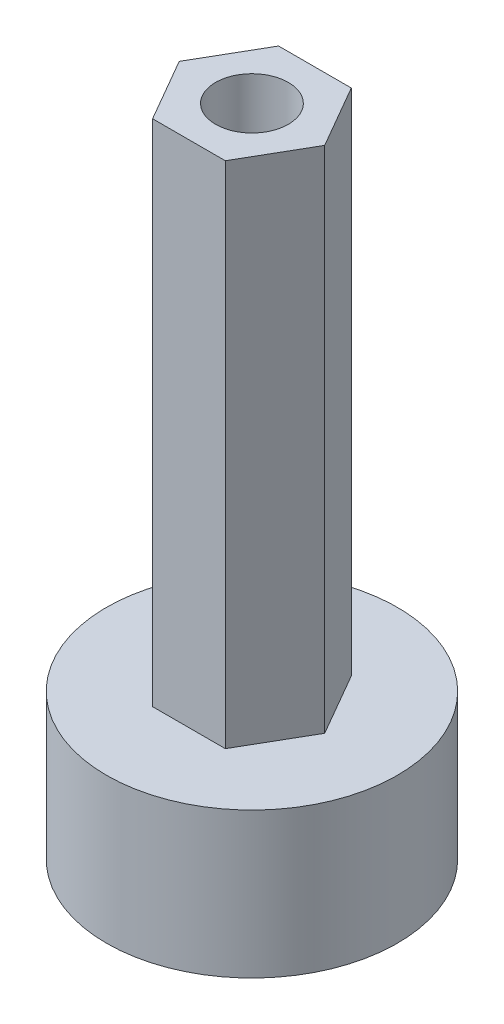
ISO-10303-21;
HEADER;
FILE_DESCRIPTION(('STEP AP214'),'2;1');
FILE_NAME('part.step','',(''),(''),'','','');
FILE_SCHEMA(('AUTOMOTIVE_DESIGN { 1 0 10303 214 1 1 1 1 }'));
ENDSEC;
DATA;
#1=APPLICATION_CONTEXT('core data for automotive mechanical design processes');
#2=APPLICATION_PROTOCOL_DEFINITION('international standard','automotive_design',2000,#1);
#3=PRODUCT_CONTEXT('',#1,'mechanical');
#4=PRODUCT('Part','Part','',(#3));
#5=PRODUCT_RELATED_PRODUCT_CATEGORY('part','',(#4));
#6=PRODUCT_DEFINITION_FORMATION('','',#4);
#7=PRODUCT_DEFINITION_CONTEXT('part definition',#1,'design');
#8=PRODUCT_DEFINITION('design','',#6,#7);
#9=PRODUCT_DEFINITION_SHAPE('','',#8);
#10=(LENGTH_UNIT() NAMED_UNIT(*) SI_UNIT(.MILLI.,.METRE.));
#11=(NAMED_UNIT(*) PLANE_ANGLE_UNIT() SI_UNIT($,.RADIAN.));
#12=(NAMED_UNIT(*) SI_UNIT($,.STERADIAN.) SOLID_ANGLE_UNIT());
#13=UNCERTAINTY_MEASURE_WITH_UNIT(LENGTH_MEASURE(1.E-05),#10,'distance_accuracy_value','');
#14=(GEOMETRIC_REPRESENTATION_CONTEXT(3) GLOBAL_UNCERTAINTY_ASSIGNED_CONTEXT((#13)) GLOBAL_UNIT_ASSIGNED_CONTEXT((#10,
#11,#12)) REPRESENTATION_CONTEXT('',''));
#15=CARTESIAN_POINT('',(0.,0.,0.));
#16=DIRECTION('',(0.,0.,1.));
#17=DIRECTION('',(1.,0.,0.));
#18=AXIS2_PLACEMENT_3D('',#15,#16,#17);
#19=CARTESIAN_POINT('',(3.175,28.575,0.));
#20=DIRECTION('',(0.,-1.,0.));
#21=DIRECTION('',(0.,0.,-1.));
#22=AXIS2_PLACEMENT_3D('',#19,#20,#21);
#23=PLANE('',#22);
#24=CARTESIAN_POINT('',(0.,28.575,0.));
#25=DIRECTION('',(0.,1.,0.));
#26=DIRECTION('',(0.,0.,1.));
#27=AXIS2_PLACEMENT_3D('',#24,#25,#26);
#28=CIRCLE('',#27,1.58749999999999);
#29=CARTESIAN_POINT('',(0.,28.575,1.58749999999999));
#30=VERTEX_POINT('',#29);
#31=EDGE_CURVE('E277',#30,#30,#28,.T.);
#32=ORIENTED_EDGE('',*,*,#31,.F.);
#33=EDGE_LOOP('',(#32));
#34=FACE_BOUND('',#33,.T.);
#35=DIRECTION('',(0.5,0.,0.866025403784438));
#36=VECTOR('',#35,1.);
#37=CARTESIAN_POINT('',(-2.38124999999999,28.575,1.37481532850779));
#38=LINE('',#37,#36);
#39=CARTESIAN_POINT('',(-3.17499999999998,28.575,0.));
#40=VERTEX_POINT('',#39);
#41=CARTESIAN_POINT('',(-1.5875,28.575,2.74963065701558));
#42=VERTEX_POINT('',#41);
#43=EDGE_CURVE('E95',#40,#42,#38,.T.);
#44=ORIENTED_EDGE('',*,*,#43,.T.);
#45=DIRECTION('',(1.,0.,0.));
#46=VECTOR('',#45,1.);
#47=CARTESIAN_POINT('',(0.,28.575,2.74963065701559));
#48=LINE('',#47,#46);
#49=CARTESIAN_POINT('',(1.58750000000001,28.575,2.74963065701559));
#50=VERTEX_POINT('',#49);
#51=EDGE_CURVE('E267',#42,#50,#48,.T.);
#52=ORIENTED_EDGE('',*,*,#51,.T.);
#53=DIRECTION('',(0.5,0.,-0.866025403784439));
#54=VECTOR('',#53,1.);
#55=CARTESIAN_POINT('',(2.38125,28.575,1.37481532850779));
#56=LINE('',#55,#54);
#57=CARTESIAN_POINT('',(3.175,28.575,0.));
#58=VERTEX_POINT('',#57);
#59=EDGE_CURVE('E234',#50,#58,#56,.T.);
#60=ORIENTED_EDGE('',*,*,#59,.T.);
#61=DIRECTION('',(-0.5,0.,-0.866025403784439));
#62=VECTOR('',#61,1.);
#63=CARTESIAN_POINT('',(2.38125,28.575,-1.37481532850779));
#64=LINE('',#63,#62);
#65=CARTESIAN_POINT('',(1.58749999999999,28.575,-2.7496306570156));
#66=VERTEX_POINT('',#65);
#67=EDGE_CURVE('E258',#58,#66,#64,.T.);
#68=ORIENTED_EDGE('',*,*,#67,.T.);
#69=DIRECTION('',(-1.,0.,0.));
#70=VECTOR('',#69,1.);
#71=CARTESIAN_POINT('',(0.,28.575,-2.74963065701559));
#72=LINE('',#71,#70);
#73=CARTESIAN_POINT('',(-1.5875,28.575,-2.74963065701558));
#74=VERTEX_POINT('',#73);
#75=EDGE_CURVE('E241',#66,#74,#72,.T.);
#76=ORIENTED_EDGE('',*,*,#75,.T.);
#77=DIRECTION('',(-0.5,0.,0.866025403784439));
#78=VECTOR('',#77,1.);
#79=CARTESIAN_POINT('',(-2.38125,28.575,-1.37481532850779));
#80=LINE('',#79,#78);
#81=EDGE_CURVE('E249',#74,#40,#80,.T.);
#82=ORIENTED_EDGE('',*,*,#81,.T.);
#83=EDGE_LOOP('',(#44,#52,#60,#68,#76,#82));
#84=FACE_BOUND('',#83,.T.);
#85=ADVANCED_FACE('F80',(#34,#84),#23,.F.);
#86=CARTESIAN_POINT('',(3.17500000000001,3.175,0.));
#87=DIRECTION('',(0.,1.,0.));
#88=DIRECTION('',(0.,0.,1.));
#89=AXIS2_PLACEMENT_3D('',#86,#87,#88);
#90=PLANE('',#89);
#91=DIRECTION('',(-0.5,0.,0.866025403784439));
#92=VECTOR('',#91,1.);
#93=CARTESIAN_POINT('',(2.74963065701559,3.175,1.5875));
#94=LINE('',#93,#92);
#95=CARTESIAN_POINT('',(3.66617420935412,3.175,0.));
#96=VERTEX_POINT('',#95);
#97=CARTESIAN_POINT('',(1.83308710467706,3.175,3.17499999999999));
#98=VERTEX_POINT('',#97);
#99=EDGE_CURVE('E222',#96,#98,#94,.T.);
#100=ORIENTED_EDGE('',*,*,#99,.T.);
#101=DIRECTION('',(-1.,0.,0.));
#102=VECTOR('',#101,1.);
#103=CARTESIAN_POINT('',(0.,3.175,3.17499999999999));
#104=LINE('',#103,#102);
#105=CARTESIAN_POINT('',(-1.83308710467706,3.175,3.17499999999999));
#106=VERTEX_POINT('',#105);
#107=EDGE_CURVE('E214',#98,#106,#104,.T.);
#108=ORIENTED_EDGE('',*,*,#107,.T.);
#109=DIRECTION('',(-0.499999999999999,0.,-0.866025403784439));
#110=VECTOR('',#109,1.);
#111=CARTESIAN_POINT('',(-2.74963065701559,3.175,1.5875));
#112=LINE('',#111,#110);
#113=CARTESIAN_POINT('',(-3.66617420935412,3.175,0.));
#114=VERTEX_POINT('',#113);
#115=EDGE_CURVE('E179',#106,#114,#112,.T.);
#116=ORIENTED_EDGE('',*,*,#115,.T.);
#117=DIRECTION('',(0.5,0.,-0.866025403784438));
#118=VECTOR('',#117,1.);
#119=CARTESIAN_POINT('',(-2.74963065701559,3.175,-1.5875));
#120=LINE('',#119,#118);
#121=CARTESIAN_POINT('',(-1.83308710467706,3.175,-3.17499999999999));
#122=VERTEX_POINT('',#121);
#123=EDGE_CURVE('E195',#114,#122,#120,.T.);
#124=ORIENTED_EDGE('',*,*,#123,.T.);
#125=DIRECTION('',(1.,0.,0.));
#126=VECTOR('',#125,1.);
#127=CARTESIAN_POINT('',(0.,3.175,-3.17499999999999));
#128=LINE('',#127,#126);
#129=CARTESIAN_POINT('',(1.83308710467706,3.175,-3.17499999999999));
#130=VERTEX_POINT('',#129);
#131=EDGE_CURVE('E203',#122,#130,#128,.T.);
#132=ORIENTED_EDGE('',*,*,#131,.T.);
#133=DIRECTION('',(0.5,0.,0.866025403784439));
#134=VECTOR('',#133,1.);
#135=CARTESIAN_POINT('',(2.74963065701559,3.175,-1.5875));
#136=LINE('',#135,#134);
#137=EDGE_CURVE('E227',#130,#96,#136,.T.);
#138=ORIENTED_EDGE('',*,*,#137,.T.);
#139=EDGE_LOOP('',(#100,#108,#116,#124,#132,#138));
#140=FACE_BOUND('',#139,.T.);
#141=CARTESIAN_POINT('',(0.,3.175,0.));
#142=DIRECTION('',(0.,1.,0.));
#143=DIRECTION('',(0.,0.,1.));
#144=AXIS2_PLACEMENT_3D('',#141,#142,#143);
#145=CIRCLE('',#144,1.58749999999999);
#146=CARTESIAN_POINT('',(0.,3.175,1.58749999999999));
#147=VERTEX_POINT('',#146);
#148=EDGE_CURVE('E252',#147,#147,#145,.T.);
#149=ORIENTED_EDGE('',*,*,#148,.T.);
#150=EDGE_LOOP('',(#149));
#151=FACE_BOUND('',#150,.T.);
#152=ADVANCED_FACE('F82',(#140,#151),#90,.F.);
#153=CARTESIAN_POINT('',(6.35,0.,0.));
#154=DIRECTION('',(0.,1.,0.));
#155=DIRECTION('',(0.,0.,1.));
#156=AXIS2_PLACEMENT_3D('',#153,#154,#155);
#157=PLANE('',#156);
#158=CARTESIAN_POINT('',(0.,0.,0.));
#159=DIRECTION('',(0.,1.,0.));
#160=DIRECTION('',(0.,0.,1.));
#161=AXIS2_PLACEMENT_3D('',#158,#159,#160);
#162=CIRCLE('',#161,6.34999999999999);
#163=CARTESIAN_POINT('',(0.,0.,6.34999999999999));
#164=VERTEX_POINT('',#163);
#165=EDGE_CURVE('E12',#164,#164,#162,.T.);
#166=ORIENTED_EDGE('',*,*,#165,.F.);
#167=EDGE_LOOP('',(#166));
#168=FACE_BOUND('',#167,.T.);
#169=DIRECTION('',(0.5,0.,-0.866025403784438));
#170=VECTOR('',#169,1.);
#171=CARTESIAN_POINT('',(-2.74963065701559,0.,-1.5875));
#172=LINE('',#171,#170);
#173=CARTESIAN_POINT('',(-3.66617420935412,0.,0.));
#174=VERTEX_POINT('',#173);
#175=CARTESIAN_POINT('',(-1.83308710467706,0.,-3.175));
#176=VERTEX_POINT('',#175);
#177=EDGE_CURVE('E184',#174,#176,#172,.T.);
#178=ORIENTED_EDGE('',*,*,#177,.F.);
#179=DIRECTION('',(-0.5,0.,-0.866025403784439));
#180=VECTOR('',#179,1.);
#181=CARTESIAN_POINT('',(-2.74963065701559,0.,1.5875));
#182=LINE('',#181,#180);
#183=CARTESIAN_POINT('',(-1.83308710467706,0.,3.17499999999999));
#184=VERTEX_POINT('',#183);
#185=EDGE_CURVE('E170',#184,#174,#182,.T.);
#186=ORIENTED_EDGE('',*,*,#185,.F.);
#187=DIRECTION('',(-1.,0.,0.));
#188=VECTOR('',#187,1.);
#189=CARTESIAN_POINT('',(0.,0.,3.17499999999999));
#190=LINE('',#189,#188);
#191=CARTESIAN_POINT('',(1.83308710467706,0.,3.17499999999999));
#192=VERTEX_POINT('',#191);
#193=EDGE_CURVE('E180',#192,#184,#190,.T.);
#194=ORIENTED_EDGE('',*,*,#193,.F.);
#195=DIRECTION('',(-0.5,0.,0.866025403784439));
#196=VECTOR('',#195,1.);
#197=CARTESIAN_POINT('',(2.74963065701559,0.,1.5875));
#198=LINE('',#197,#196);
#199=CARTESIAN_POINT('',(3.66617420935412,0.,0.));
#200=VERTEX_POINT('',#199);
#201=EDGE_CURVE('E219',#200,#192,#198,.T.);
#202=ORIENTED_EDGE('',*,*,#201,.F.);
#203=DIRECTION('',(0.5,0.,0.866025403784439));
#204=VECTOR('',#203,1.);
#205=CARTESIAN_POINT('',(2.74963065701559,0.,-1.5875));
#206=LINE('',#205,#204);
#207=CARTESIAN_POINT('',(1.83308710467706,0.,-3.17499999999999));
#208=VERTEX_POINT('',#207);
#209=EDGE_CURVE('E209',#208,#200,#206,.T.);
#210=ORIENTED_EDGE('',*,*,#209,.F.);
#211=DIRECTION('',(1.,0.,0.));
#212=VECTOR('',#211,1.);
#213=CARTESIAN_POINT('',(0.,0.,-3.17499999999999));
#214=LINE('',#213,#212);
#215=EDGE_CURVE('E187',#176,#208,#214,.T.);
#216=ORIENTED_EDGE('',*,*,#215,.F.);
#217=EDGE_LOOP('',(#178,#186,#194,#202,#210,#216));
#218=FACE_BOUND('',#217,.T.);
#219=ADVANCED_FACE('F185',(#168,#218),#157,.F.);
#220=CARTESIAN_POINT('',(0.,41.2270126092031,0.));
#221=DIRECTION('',(0.,1.,0.));
#222=DIRECTION('',(0.,0.,1.));
#223=AXIS2_PLACEMENT_3D('',#220,#221,#222);
#224=CYLINDRICAL_SURFACE('',#223,6.34999999999999);
#225=CARTESIAN_POINT('',(0.,6.35,0.));
#226=DIRECTION('',(0.,1.,0.));
#227=DIRECTION('',(0.,0.,1.));
#228=AXIS2_PLACEMENT_3D('',#225,#226,#227);
#229=CIRCLE('',#228,6.34999999999999);
#230=CARTESIAN_POINT('',(0.,6.35,6.34999999999999));
#231=VERTEX_POINT('',#230);
#232=EDGE_CURVE('E88',#231,#231,#229,.T.);
#233=ORIENTED_EDGE('',*,*,#232,.F.);
#234=EDGE_LOOP('',(#233));
#235=FACE_BOUND('',#234,.T.);
#236=ORIENTED_EDGE('',*,*,#165,.T.);
#237=EDGE_LOOP('',(#236));
#238=FACE_BOUND('',#237,.T.);
#239=ADVANCED_FACE('F284',(#235,#238),#224,.T.);
#240=CARTESIAN_POINT('',(6.35,6.35,0.));
#241=DIRECTION('',(0.,-1.,0.));
#242=DIRECTION('',(0.,0.,-1.));
#243=AXIS2_PLACEMENT_3D('',#240,#241,#242);
#244=PLANE('',#243);
#245=DIRECTION('',(-0.5,0.,-0.866025403784439));
#246=VECTOR('',#245,1.);
#247=CARTESIAN_POINT('',(2.38125,6.35,-1.37481532850779));
#248=LINE('',#247,#246);
#249=CARTESIAN_POINT('',(3.175,6.35,0.));
#250=VERTEX_POINT('',#249);
#251=CARTESIAN_POINT('',(1.58749999999999,6.35,-2.7496306570156));
#252=VERTEX_POINT('',#251);
#253=EDGE_CURVE('E264',#250,#252,#248,.T.);
#254=ORIENTED_EDGE('',*,*,#253,.F.);
#255=DIRECTION('',(0.5,0.,-0.866025403784439));
#256=VECTOR('',#255,1.);
#257=CARTESIAN_POINT('',(2.38125,6.35,1.37481532850779));
#258=LINE('',#257,#256);
#259=CARTESIAN_POINT('',(1.58750000000001,6.35,2.74963065701559));
#260=VERTEX_POINT('',#259);
#261=EDGE_CURVE('E232',#260,#250,#258,.T.);
#262=ORIENTED_EDGE('',*,*,#261,.F.);
#263=DIRECTION('',(1.,0.,0.));
#264=VECTOR('',#263,1.);
#265=CARTESIAN_POINT('',(0.,6.35,2.74963065701559));
#266=LINE('',#265,#264);
#267=CARTESIAN_POINT('',(-1.5875,6.35,2.74963065701558));
#268=VERTEX_POINT('',#267);
#269=EDGE_CURVE('E244',#268,#260,#266,.T.);
#270=ORIENTED_EDGE('',*,*,#269,.F.);
#271=DIRECTION('',(0.5,0.,0.866025403784438));
#272=VECTOR('',#271,1.);
#273=CARTESIAN_POINT('',(-2.38124999999999,6.35,1.37481532850779));
#274=LINE('',#273,#272);
#275=CARTESIAN_POINT('',(-3.17499999999998,6.35,0.));
#276=VERTEX_POINT('',#275);
#277=EDGE_CURVE('E218',#276,#268,#274,.T.);
#278=ORIENTED_EDGE('',*,*,#277,.F.);
#279=DIRECTION('',(-0.5,0.,0.866025403784439));
#280=VECTOR('',#279,1.);
#281=CARTESIAN_POINT('',(-2.38125,6.35,-1.37481532850779));
#282=LINE('',#281,#280);
#283=CARTESIAN_POINT('',(-1.5875,6.35,-2.74963065701558));
#284=VERTEX_POINT('',#283);
#285=EDGE_CURVE('E254',#284,#276,#282,.T.);
#286=ORIENTED_EDGE('',*,*,#285,.F.);
#287=DIRECTION('',(-1.,0.,0.));
#288=VECTOR('',#287,1.);
#289=CARTESIAN_POINT('',(0.,6.35,-2.74963065701559));
#290=LINE('',#289,#288);
#291=EDGE_CURVE('E104',#252,#284,#290,.T.);
#292=ORIENTED_EDGE('',*,*,#291,.F.);
#293=EDGE_LOOP('',(#254,#262,#270,#278,#286,#292));
#294=FACE_BOUND('',#293,.T.);
#295=ORIENTED_EDGE('',*,*,#232,.T.);
#296=EDGE_LOOP('',(#295));
#297=FACE_BOUND('',#296,.T.);
#298=ADVANCED_FACE('F282',(#294,#297),#244,.F.);
#299=CARTESIAN_POINT('',(0.,41.2270126092031,0.));
#300=DIRECTION('',(0.,1.,0.));
#301=DIRECTION('',(0.,0.,1.));
#302=AXIS2_PLACEMENT_3D('',#299,#300,#301);
#303=CYLINDRICAL_SURFACE('',#302,1.58749999999999);
#304=ORIENTED_EDGE('',*,*,#148,.F.);
#305=EDGE_LOOP('',(#304));
#306=FACE_BOUND('',#305,.T.);
#307=ORIENTED_EDGE('',*,*,#31,.T.);
#308=EDGE_LOOP('',(#307));
#309=FACE_BOUND('',#308,.T.);
#310=ADVANCED_FACE('F304',(#306,#309),#303,.F.);
#311=CARTESIAN_POINT('',(0.,3.14663238482515,2.74963065701559));
#312=DIRECTION('',(0.,0.,1.));
#313=DIRECTION('',(1.,0.,0.));
#314=AXIS2_PLACEMENT_3D('',#311,#312,#313);
#315=PLANE('',#314);
#316=ORIENTED_EDGE('',*,*,#269,.T.);
#317=DIRECTION('',(0.,1.,0.));
#318=VECTOR('',#317,1.);
#319=CARTESIAN_POINT('',(1.58750000000001,3.14663238482515,2.74963065701559));
#320=LINE('',#319,#318);
#321=EDGE_CURVE('E237',#260,#50,#320,.T.);
#322=ORIENTED_EDGE('',*,*,#321,.T.);
#323=ORIENTED_EDGE('',*,*,#51,.F.);
#324=DIRECTION('',(0.,1.,0.));
#325=VECTOR('',#324,1.);
#326=CARTESIAN_POINT('',(-1.5875,3.14663238482515,2.74963065701558));
#327=LINE('',#326,#325);
#328=EDGE_CURVE('E271',#268,#42,#327,.T.);
#329=ORIENTED_EDGE('',*,*,#328,.F.);
#330=EDGE_LOOP('',(#316,#322,#323,#329));
#331=FACE_BOUND('',#330,.T.);
#332=ADVANCED_FACE('F311',(#331),#315,.T.);
#333=CARTESIAN_POINT('',(2.38125,3.14663238482515,-1.37481532850779));
#334=DIRECTION('',(0.866025403784439,0.,-0.5));
#335=DIRECTION('',(-0.5,0.,-0.866025403784439));
#336=AXIS2_PLACEMENT_3D('',#333,#334,#335);
#337=PLANE('',#336);
#338=ORIENTED_EDGE('',*,*,#253,.T.);
#339=DIRECTION('',(0.,1.,0.));
#340=VECTOR('',#339,1.);
#341=CARTESIAN_POINT('',(1.58749999999999,3.14663238482515,-2.7496306570156));
#342=LINE('',#341,#340);
#343=EDGE_CURVE('E245',#252,#66,#342,.T.);
#344=ORIENTED_EDGE('',*,*,#343,.T.);
#345=ORIENTED_EDGE('',*,*,#67,.F.);
#346=DIRECTION('',(0.,1.,0.));
#347=VECTOR('',#346,1.);
#348=CARTESIAN_POINT('',(3.175,3.14663238482515,0.));
#349=LINE('',#348,#347);
#350=EDGE_CURVE('E263',#250,#58,#349,.T.);
#351=ORIENTED_EDGE('',*,*,#350,.F.);
#352=EDGE_LOOP('',(#338,#344,#345,#351));
#353=FACE_BOUND('',#352,.T.);
#354=ADVANCED_FACE('F319',(#353),#337,.T.);
#355=CARTESIAN_POINT('',(-2.38125,3.14663238482515,-1.37481532850779));
#356=DIRECTION('',(-0.866025403784439,0.,-0.499999999999999));
#357=DIRECTION('',(-0.5,0.,0.866025403784439));
#358=AXIS2_PLACEMENT_3D('',#355,#356,#357);
#359=PLANE('',#358);
#360=ORIENTED_EDGE('',*,*,#285,.T.);
#361=DIRECTION('',(0.,1.,0.));
#362=VECTOR('',#361,1.);
#363=CARTESIAN_POINT('',(-3.17499999999998,3.14663238482515,0.));
#364=LINE('',#363,#362);
#365=EDGE_CURVE('E257',#276,#40,#364,.T.);
#366=ORIENTED_EDGE('',*,*,#365,.T.);
#367=ORIENTED_EDGE('',*,*,#81,.F.);
#368=DIRECTION('',(0.,1.,0.));
#369=VECTOR('',#368,1.);
#370=CARTESIAN_POINT('',(-1.5875,3.14663238482515,-2.74963065701558));
#371=LINE('',#370,#369);
#372=EDGE_CURVE('E253',#284,#74,#371,.T.);
#373=ORIENTED_EDGE('',*,*,#372,.F.);
#374=EDGE_LOOP('',(#360,#366,#367,#373));
#375=FACE_BOUND('',#374,.T.);
#376=ADVANCED_FACE('F329',(#375),#359,.T.);
#377=CARTESIAN_POINT('',(0.,3.14663238482515,-2.74963065701559));
#378=DIRECTION('',(0.,0.,-1.));
#379=DIRECTION('',(-1.,0.,0.));
#380=AXIS2_PLACEMENT_3D('',#377,#378,#379);
#381=PLANE('',#380);
#382=ORIENTED_EDGE('',*,*,#291,.T.);
#383=ORIENTED_EDGE('',*,*,#372,.T.);
#384=ORIENTED_EDGE('',*,*,#75,.F.);
#385=ORIENTED_EDGE('',*,*,#343,.F.);
#386=EDGE_LOOP('',(#382,#383,#384,#385));
#387=FACE_BOUND('',#386,.T.);
#388=ADVANCED_FACE('F330',(#387),#381,.T.);
#389=CARTESIAN_POINT('',(2.38125,3.14663238482515,1.37481532850779));
#390=DIRECTION('',(0.866025403784439,0.,0.5));
#391=DIRECTION('',(0.5,0.,-0.866025403784439));
#392=AXIS2_PLACEMENT_3D('',#389,#390,#391);
#393=PLANE('',#392);
#394=ORIENTED_EDGE('',*,*,#261,.T.);
#395=ORIENTED_EDGE('',*,*,#350,.T.);
#396=ORIENTED_EDGE('',*,*,#59,.F.);
#397=ORIENTED_EDGE('',*,*,#321,.F.);
#398=EDGE_LOOP('',(#394,#395,#396,#397));
#399=FACE_BOUND('',#398,.T.);
#400=ADVANCED_FACE('F321',(#399),#393,.T.);
#401=CARTESIAN_POINT('',(-2.38124999999999,3.14663238482515,1.37481532850779));
#402=DIRECTION('',(-0.866025403784438,0.,0.5));
#403=DIRECTION('',(0.5,0.,0.866025403784438));
#404=AXIS2_PLACEMENT_3D('',#401,#402,#403);
#405=PLANE('',#404);
#406=ORIENTED_EDGE('',*,*,#277,.T.);
#407=ORIENTED_EDGE('',*,*,#328,.T.);
#408=ORIENTED_EDGE('',*,*,#43,.F.);
#409=ORIENTED_EDGE('',*,*,#365,.F.);
#410=EDGE_LOOP('',(#406,#407,#408,#409));
#411=FACE_BOUND('',#410,.T.);
#412=ADVANCED_FACE('F326',(#411),#405,.T.);
#413=CARTESIAN_POINT('',(-2.74963065701559,6.47964477415249,1.5875));
#414=DIRECTION('',(-0.866025403784439,0.,0.5));
#415=DIRECTION('',(0.499999999999999,0.,0.866025403784439));
#416=AXIS2_PLACEMENT_3D('',#413,#414,#415);
#417=PLANE('',#416);
#418=DIRECTION('',(0.,-1.,0.));
#419=VECTOR('',#418,1.);
#420=CARTESIAN_POINT('',(-1.83308710467706,6.47964477415249,3.17499999999999));
#421=LINE('',#420,#419);
#422=EDGE_CURVE('E176',#106,#184,#421,.T.);
#423=ORIENTED_EDGE('',*,*,#422,.T.);
#424=ORIENTED_EDGE('',*,*,#185,.T.);
#425=DIRECTION('',(0.,-1.,0.));
#426=VECTOR('',#425,1.);
#427=CARTESIAN_POINT('',(-3.66617420935412,6.47964477415249,0.));
#428=LINE('',#427,#426);
#429=EDGE_CURVE('E174',#114,#174,#428,.T.);
#430=ORIENTED_EDGE('',*,*,#429,.F.);
#431=ORIENTED_EDGE('',*,*,#115,.F.);
#432=EDGE_LOOP('',(#423,#424,#430,#431));
#433=FACE_BOUND('',#432,.T.);
#434=ADVANCED_FACE('F172',(#433),#417,.F.);
#435=CARTESIAN_POINT('',(0.,6.47964477415249,3.17499999999999));
#436=DIRECTION('',(0.,0.,1.));
#437=DIRECTION('',(1.,0.,0.));
#438=AXIS2_PLACEMENT_3D('',#435,#436,#437);
#439=PLANE('',#438);
#440=ORIENTED_EDGE('',*,*,#107,.F.);
#441=DIRECTION('',(0.,-1.,0.));
#442=VECTOR('',#441,1.);
#443=CARTESIAN_POINT('',(1.83308710467706,6.47964477415249,3.17499999999999));
#444=LINE('',#443,#442);
#445=EDGE_CURVE('E190',#98,#192,#444,.T.);
#446=ORIENTED_EDGE('',*,*,#445,.T.);
#447=ORIENTED_EDGE('',*,*,#193,.T.);
#448=ORIENTED_EDGE('',*,*,#422,.F.);
#449=EDGE_LOOP('',(#440,#446,#447,#448));
#450=FACE_BOUND('',#449,.T.);
#451=ADVANCED_FACE('F394',(#450),#439,.F.);
#452=CARTESIAN_POINT('',(2.74963065701559,6.47964477415249,1.5875));
#453=DIRECTION('',(0.866025403784439,0.,0.5));
#454=DIRECTION('',(0.5,0.,-0.866025403784439));
#455=AXIS2_PLACEMENT_3D('',#452,#453,#454);
#456=PLANE('',#455);
#457=DIRECTION('',(0.,-1.,0.));
#458=VECTOR('',#457,1.);
#459=CARTESIAN_POINT('',(3.66617420935412,6.47964477415249,0.));
#460=LINE('',#459,#458);
#461=EDGE_CURVE('E212',#96,#200,#460,.T.);
#462=ORIENTED_EDGE('',*,*,#461,.T.);
#463=ORIENTED_EDGE('',*,*,#201,.T.);
#464=ORIENTED_EDGE('',*,*,#445,.F.);
#465=ORIENTED_EDGE('',*,*,#99,.F.);
#466=EDGE_LOOP('',(#462,#463,#464,#465));
#467=FACE_BOUND('',#466,.T.);
#468=ADVANCED_FACE('F404',(#467),#456,.F.);
#469=CARTESIAN_POINT('',(2.74963065701559,6.47964477415249,-1.5875));
#470=DIRECTION('',(0.866025403784439,0.,-0.5));
#471=DIRECTION('',(-0.5,0.,-0.866025403784439));
#472=AXIS2_PLACEMENT_3D('',#469,#470,#471);
#473=PLANE('',#472);
#474=ORIENTED_EDGE('',*,*,#137,.F.);
#475=DIRECTION('',(0.,-1.,0.));
#476=VECTOR('',#475,1.);
#477=CARTESIAN_POINT('',(1.83308710467706,6.47964477415249,-3.17499999999999));
#478=LINE('',#477,#476);
#479=EDGE_CURVE('E196',#130,#208,#478,.T.);
#480=ORIENTED_EDGE('',*,*,#479,.T.);
#481=ORIENTED_EDGE('',*,*,#209,.T.);
#482=ORIENTED_EDGE('',*,*,#461,.F.);
#483=EDGE_LOOP('',(#474,#480,#481,#482));
#484=FACE_BOUND('',#483,.T.);
#485=ADVANCED_FACE('F415',(#484),#473,.F.);
#486=CARTESIAN_POINT('',(0.,6.47964477415249,-3.17499999999999));
#487=DIRECTION('',(0.,0.,-1.));
#488=DIRECTION('',(-1.,0.,0.));
#489=AXIS2_PLACEMENT_3D('',#486,#487,#488);
#490=PLANE('',#489);
#491=DIRECTION('',(0.,-1.,0.));
#492=VECTOR('',#491,1.);
#493=CARTESIAN_POINT('',(-1.83308710467706,6.47964477415249,-3.175));
#494=LINE('',#493,#492);
#495=EDGE_CURVE('E208',#122,#176,#494,.T.);
#496=ORIENTED_EDGE('',*,*,#495,.T.);
#497=ORIENTED_EDGE('',*,*,#215,.T.);
#498=ORIENTED_EDGE('',*,*,#479,.F.);
#499=ORIENTED_EDGE('',*,*,#131,.F.);
#500=EDGE_LOOP('',(#496,#497,#498,#499));
#501=FACE_BOUND('',#500,.T.);
#502=ADVANCED_FACE('F426',(#501),#490,.F.);
#503=CARTESIAN_POINT('',(-2.74963065701559,6.47964477415249,-1.5875));
#504=DIRECTION('',(-0.866025403784438,0.,-0.5));
#505=DIRECTION('',(-0.5,0.,0.866025403784438));
#506=AXIS2_PLACEMENT_3D('',#503,#504,#505);
#507=PLANE('',#506);
#508=ORIENTED_EDGE('',*,*,#123,.F.);
#509=ORIENTED_EDGE('',*,*,#429,.T.);
#510=ORIENTED_EDGE('',*,*,#177,.T.);
#511=ORIENTED_EDGE('',*,*,#495,.F.);
#512=EDGE_LOOP('',(#508,#509,#510,#511));
#513=FACE_BOUND('',#512,.T.);
#514=ADVANCED_FACE('F193',(#513),#507,.F.);
#515=CLOSED_SHELL('',(#85,#152,#219,#239,#298,#310,#332,#354,#376,#388,#400,#412,#434,#451,#468,
#485,#502,#514));
#516=MANIFOLD_SOLID_BREP('B2',#515);
#517=ADVANCED_BREP_SHAPE_REPRESENTATION('',(#18,#516),#14);
#518=SHAPE_DEFINITION_REPRESENTATION(#9,#517);
ENDSEC;
END-ISO-10303-21;
